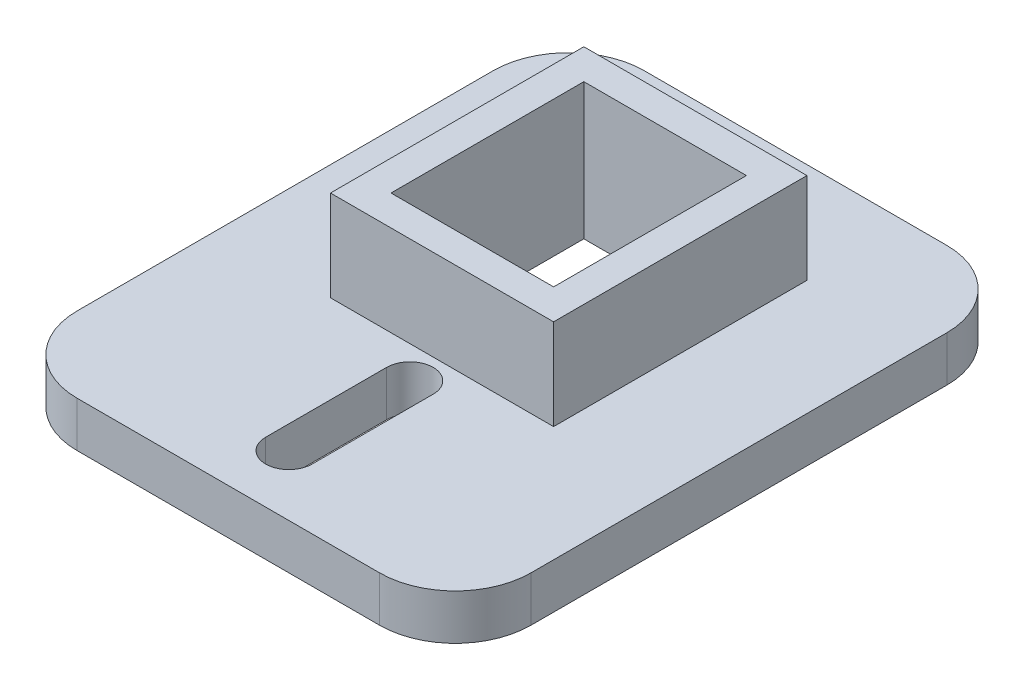
ISO-10303-21;
HEADER;
FILE_DESCRIPTION(('STEP AP214'),'2;1');
FILE_NAME('part.step','',(''),(''),'','','');
FILE_SCHEMA(('AUTOMOTIVE_DESIGN { 1 0 10303 214 1 1 1 1 }'));
ENDSEC;
DATA;
#1=APPLICATION_CONTEXT('core data for automotive mechanical design processes');
#2=APPLICATION_PROTOCOL_DEFINITION('international standard','automotive_design',2000,#1);
#3=PRODUCT_CONTEXT('',#1,'mechanical');
#4=PRODUCT('Part','Part','',(#3));
#5=PRODUCT_RELATED_PRODUCT_CATEGORY('part','',(#4));
#6=PRODUCT_DEFINITION_FORMATION('','',#4);
#7=PRODUCT_DEFINITION_CONTEXT('part definition',#1,'design');
#8=PRODUCT_DEFINITION('design','',#6,#7);
#9=PRODUCT_DEFINITION_SHAPE('','',#8);
#10=(LENGTH_UNIT() NAMED_UNIT(*) SI_UNIT(.MILLI.,.METRE.));
#11=(NAMED_UNIT(*) PLANE_ANGLE_UNIT() SI_UNIT($,.RADIAN.));
#12=(NAMED_UNIT(*) SI_UNIT($,.STERADIAN.) SOLID_ANGLE_UNIT());
#13=UNCERTAINTY_MEASURE_WITH_UNIT(LENGTH_MEASURE(1.E-05),#10,'distance_accuracy_value','');
#14=(GEOMETRIC_REPRESENTATION_CONTEXT(3) GLOBAL_UNCERTAINTY_ASSIGNED_CONTEXT((#13)) GLOBAL_UNIT_ASSIGNED_CONTEXT((#10,
#11,#12)) REPRESENTATION_CONTEXT('',''));
#15=CARTESIAN_POINT('',(0.,0.,0.));
#16=DIRECTION('',(0.,0.,1.));
#17=DIRECTION('',(1.,0.,0.));
#18=AXIS2_PLACEMENT_3D('',#15,#16,#17);
#19=CARTESIAN_POINT('',(0.,3.,0.));
#20=DIRECTION('',(0.,-1.,0.));
#21=DIRECTION('',(0.,0.,-1.));
#22=AXIS2_PLACEMENT_3D('',#19,#20,#21);
#23=PLANE('',#22);
#24=CARTESIAN_POINT('',(0.,3.,11.125));
#25=DIRECTION('',(0.,1.,0.));
#26=DIRECTION('',(0.,0.,1.));
#27=AXIS2_PLACEMENT_3D('',#24,#25,#26);
#28=CIRCLE('',#27,1.5375);
#29=CARTESIAN_POINT('',(1.5375,3.,11.125));
#30=VERTEX_POINT('',#29);
#31=CARTESIAN_POINT('',(-1.5375,3.,11.125));
#32=VERTEX_POINT('',#31);
#33=EDGE_CURVE('E226',#30,#32,#28,.T.);
#34=ORIENTED_EDGE('',*,*,#33,.F.);
#35=DIRECTION('',(0.,0.,-1.));
#36=VECTOR('',#35,1.);
#37=CARTESIAN_POINT('',(1.5375,3.,11.125));
#38=LINE('',#37,#36);
#39=CARTESIAN_POINT('',(1.5375,3.,19.125));
#40=VERTEX_POINT('',#39);
#41=EDGE_CURVE('E234',#40,#30,#38,.T.);
#42=ORIENTED_EDGE('',*,*,#41,.F.);
#43=CARTESIAN_POINT('',(0.,3.,19.125));
#44=DIRECTION('',(0.,1.,0.));
#45=DIRECTION('',(0.,0.,1.));
#46=AXIS2_PLACEMENT_3D('',#43,#44,#45);
#47=CIRCLE('',#46,1.5375);
#48=CARTESIAN_POINT('',(-1.5375,3.,19.125));
#49=VERTEX_POINT('',#48);
#50=EDGE_CURVE('E231',#49,#40,#47,.T.);
#51=ORIENTED_EDGE('',*,*,#50,.F.);
#52=DIRECTION('',(0.,0.,1.));
#53=VECTOR('',#52,1.);
#54=CARTESIAN_POINT('',(-1.5375,3.,11.125));
#55=LINE('',#54,#53);
#56=EDGE_CURVE('E228',#32,#49,#55,.T.);
#57=ORIENTED_EDGE('',*,*,#56,.F.);
#58=EDGE_LOOP('',(#34,#42,#51,#57));
#59=FACE_BOUND('',#58,.T.);
#60=DIRECTION('',(1.,0.,0.));
#61=VECTOR('',#60,1.);
#62=CARTESIAN_POINT('',(-15.,3.,23.125));
#63=LINE('',#62,#61);
#64=CARTESIAN_POINT('',(-9.99999999999999,3.,23.125));
#65=VERTEX_POINT('',#64);
#66=CARTESIAN_POINT('',(10.,3.,23.125));
#67=VERTEX_POINT('',#66);
#68=EDGE_CURVE('E281',#65,#67,#63,.T.);
#69=ORIENTED_EDGE('',*,*,#68,.T.);
#70=CARTESIAN_POINT('',(10.,3.,18.125));
#71=DIRECTION('',(0.,-1.,0.));
#72=DIRECTION('',(0.,0.,-1.));
#73=AXIS2_PLACEMENT_3D('',#70,#71,#72);
#74=CIRCLE('',#73,5.);
#75=CARTESIAN_POINT('',(15.,3.,18.125));
#76=VERTEX_POINT('',#75);
#77=EDGE_CURVE('E318',#67,#76,#74,.F.);
#78=ORIENTED_EDGE('',*,*,#77,.T.);
#79=DIRECTION('',(0.,0.,-1.));
#80=VECTOR('',#79,1.);
#81=CARTESIAN_POINT('',(15.,3.,23.125));
#82=LINE('',#81,#80);
#83=CARTESIAN_POINT('',(15.,3.,-9.37500000000001));
#84=VERTEX_POINT('',#83);
#85=EDGE_CURVE('E271',#76,#84,#82,.T.);
#86=ORIENTED_EDGE('',*,*,#85,.T.);
#87=CARTESIAN_POINT('',(10.,3.,-9.375));
#88=DIRECTION('',(0.,-1.,0.));
#89=DIRECTION('',(0.,0.,-1.));
#90=AXIS2_PLACEMENT_3D('',#87,#88,#89);
#91=CIRCLE('',#90,5.);
#92=CARTESIAN_POINT('',(9.99999999999999,3.,-14.375));
#93=VERTEX_POINT('',#92);
#94=EDGE_CURVE('E314',#84,#93,#91,.F.);
#95=ORIENTED_EDGE('',*,*,#94,.T.);
#96=DIRECTION('',(-1.,0.,0.));
#97=VECTOR('',#96,1.);
#98=CARTESIAN_POINT('',(-15.,3.,-14.375));
#99=LINE('',#98,#97);
#100=CARTESIAN_POINT('',(-10.,3.,-14.375));
#101=VERTEX_POINT('',#100);
#102=EDGE_CURVE('E274',#93,#101,#99,.T.);
#103=ORIENTED_EDGE('',*,*,#102,.T.);
#104=CARTESIAN_POINT('',(-9.99999999999999,3.,-9.37499999999999));
#105=DIRECTION('',(0.,-1.,0.));
#106=DIRECTION('',(0.,0.,-1.));
#107=AXIS2_PLACEMENT_3D('',#104,#105,#106);
#108=CIRCLE('',#107,5.);
#109=CARTESIAN_POINT('',(-15.,3.,-9.37499999999999));
#110=VERTEX_POINT('',#109);
#111=EDGE_CURVE('E312',#101,#110,#108,.F.);
#112=ORIENTED_EDGE('',*,*,#111,.T.);
#113=DIRECTION('',(0.,0.,1.));
#114=VECTOR('',#113,1.);
#115=CARTESIAN_POINT('',(-15.,3.,23.125));
#116=LINE('',#115,#114);
#117=CARTESIAN_POINT('',(-15.,3.,18.125));
#118=VERTEX_POINT('',#117);
#119=EDGE_CURVE('E278',#110,#118,#116,.T.);
#120=ORIENTED_EDGE('',*,*,#119,.T.);
#121=CARTESIAN_POINT('',(-9.99999999999999,3.,18.125));
#122=DIRECTION('',(0.,-1.,0.));
#123=DIRECTION('',(0.,0.,-1.));
#124=AXIS2_PLACEMENT_3D('',#121,#122,#123);
#125=CIRCLE('',#124,5.);
#126=EDGE_CURVE('E316',#118,#65,#125,.F.);
#127=ORIENTED_EDGE('',*,*,#126,.T.);
#128=EDGE_LOOP('',(#69,#78,#86,#95,#103,#112,#120,#127));
#129=FACE_BOUND('',#128,.T.);
#130=DIRECTION('',(-1.,0.,0.));
#131=VECTOR('',#130,1.);
#132=CARTESIAN_POINT('',(-7.375,3.,-7.75));
#133=LINE('',#132,#131);
#134=CARTESIAN_POINT('',(7.375,3.,-7.75));
#135=VERTEX_POINT('',#134);
#136=CARTESIAN_POINT('',(-7.375,3.,-7.75));
#137=VERTEX_POINT('',#136);
#138=EDGE_CURVE('E197',#135,#137,#133,.T.);
#139=ORIENTED_EDGE('',*,*,#138,.F.);
#140=DIRECTION('',(0.,0.,-1.));
#141=VECTOR('',#140,1.);
#142=CARTESIAN_POINT('',(7.375,3.,-7.75));
#143=LINE('',#142,#141);
#144=CARTESIAN_POINT('',(7.375,3.,9.));
#145=VERTEX_POINT('',#144);
#146=EDGE_CURVE('E202',#145,#135,#143,.T.);
#147=ORIENTED_EDGE('',*,*,#146,.F.);
#148=DIRECTION('',(1.,0.,0.));
#149=VECTOR('',#148,1.);
#150=CARTESIAN_POINT('',(-7.375,3.,9.));
#151=LINE('',#150,#149);
#152=CARTESIAN_POINT('',(-7.375,3.,9.));
#153=VERTEX_POINT('',#152);
#154=EDGE_CURVE('E52',#153,#145,#151,.T.);
#155=ORIENTED_EDGE('',*,*,#154,.F.);
#156=DIRECTION('',(0.,0.,1.));
#157=VECTOR('',#156,1.);
#158=CARTESIAN_POINT('',(-7.375,3.,-7.75));
#159=LINE('',#158,#157);
#160=EDGE_CURVE('E47',#137,#153,#159,.T.);
#161=ORIENTED_EDGE('',*,*,#160,.F.);
#162=EDGE_LOOP('',(#139,#147,#155,#161));
#163=FACE_BOUND('',#162,.T.);
#164=ADVANCED_FACE('F32',(#59,#129,#163),#23,.F.);
#165=CARTESIAN_POINT('',(0.,0.,0.));
#166=DIRECTION('',(0.,-1.,0.));
#167=DIRECTION('',(0.,0.,-1.));
#168=AXIS2_PLACEMENT_3D('',#165,#166,#167);
#169=PLANE('',#168);
#170=DIRECTION('',(0.,0.,-1.));
#171=VECTOR('',#170,1.);
#172=CARTESIAN_POINT('',(15.,0.,23.125));
#173=LINE('',#172,#171);
#174=CARTESIAN_POINT('',(15.,0.,18.125));
#175=VERTEX_POINT('',#174);
#176=CARTESIAN_POINT('',(15.,0.,-9.37500000000001));
#177=VERTEX_POINT('',#176);
#178=EDGE_CURVE('E270',#175,#177,#173,.T.);
#179=ORIENTED_EDGE('',*,*,#178,.F.);
#180=CARTESIAN_POINT('',(10.,0.,18.125));
#181=DIRECTION('',(0.,-1.,0.));
#182=DIRECTION('',(0.,0.,-1.));
#183=AXIS2_PLACEMENT_3D('',#180,#181,#182);
#184=CIRCLE('',#183,5.);
#185=CARTESIAN_POINT('',(10.,0.,23.125));
#186=VERTEX_POINT('',#185);
#187=EDGE_CURVE('E305',#175,#186,#184,.T.);
#188=ORIENTED_EDGE('',*,*,#187,.T.);
#189=DIRECTION('',(1.,0.,0.));
#190=VECTOR('',#189,1.);
#191=CARTESIAN_POINT('',(-15.,0.,23.125));
#192=LINE('',#191,#190);
#193=CARTESIAN_POINT('',(-9.99999999999999,0.,23.125));
#194=VERTEX_POINT('',#193);
#195=EDGE_CURVE('E275',#194,#186,#192,.T.);
#196=ORIENTED_EDGE('',*,*,#195,.F.);
#197=CARTESIAN_POINT('',(-9.99999999999999,0.,18.125));
#198=DIRECTION('',(0.,-1.,0.));
#199=DIRECTION('',(0.,0.,-1.));
#200=AXIS2_PLACEMENT_3D('',#197,#198,#199);
#201=CIRCLE('',#200,5.);
#202=CARTESIAN_POINT('',(-15.,0.,18.125));
#203=VERTEX_POINT('',#202);
#204=EDGE_CURVE('E303',#194,#203,#201,.T.);
#205=ORIENTED_EDGE('',*,*,#204,.T.);
#206=DIRECTION('',(0.,0.,1.));
#207=VECTOR('',#206,1.);
#208=CARTESIAN_POINT('',(-15.,0.,23.125));
#209=LINE('',#208,#207);
#210=CARTESIAN_POINT('',(-15.,0.,-9.37499999999999));
#211=VERTEX_POINT('',#210);
#212=EDGE_CURVE('E290',#211,#203,#209,.T.);
#213=ORIENTED_EDGE('',*,*,#212,.F.);
#214=CARTESIAN_POINT('',(-9.99999999999999,0.,-9.37499999999999));
#215=DIRECTION('',(0.,-1.,0.));
#216=DIRECTION('',(0.,0.,-1.));
#217=AXIS2_PLACEMENT_3D('',#214,#215,#216);
#218=CIRCLE('',#217,5.);
#219=CARTESIAN_POINT('',(-10.,0.,-14.375));
#220=VERTEX_POINT('',#219);
#221=EDGE_CURVE('E299',#211,#220,#218,.T.);
#222=ORIENTED_EDGE('',*,*,#221,.T.);
#223=DIRECTION('',(-1.,0.,0.));
#224=VECTOR('',#223,1.);
#225=CARTESIAN_POINT('',(-15.,0.,-14.375));
#226=LINE('',#225,#224);
#227=CARTESIAN_POINT('',(9.99999999999999,0.,-14.375));
#228=VERTEX_POINT('',#227);
#229=EDGE_CURVE('E287',#228,#220,#226,.T.);
#230=ORIENTED_EDGE('',*,*,#229,.F.);
#231=CARTESIAN_POINT('',(10.,0.,-9.375));
#232=DIRECTION('',(0.,-1.,0.));
#233=DIRECTION('',(0.,0.,-1.));
#234=AXIS2_PLACEMENT_3D('',#231,#232,#233);
#235=CIRCLE('',#234,5.);
#236=EDGE_CURVE('E301',#228,#177,#235,.T.);
#237=ORIENTED_EDGE('',*,*,#236,.T.);
#238=EDGE_LOOP('',(#179,#188,#196,#205,#213,#222,#230,#237));
#239=FACE_BOUND('',#238,.T.);
#240=DIRECTION('',(1.,0.,0.));
#241=VECTOR('',#240,1.);
#242=CARTESIAN_POINT('',(-5.375,0.,7.));
#243=LINE('',#242,#241);
#244=CARTESIAN_POINT('',(-5.375,0.,7.));
#245=VERTEX_POINT('',#244);
#246=CARTESIAN_POINT('',(5.375,0.,7.));
#247=VERTEX_POINT('',#246);
#248=EDGE_CURVE('E175',#245,#247,#243,.T.);
#249=ORIENTED_EDGE('',*,*,#248,.T.);
#250=DIRECTION('',(0.,0.,-1.));
#251=VECTOR('',#250,1.);
#252=CARTESIAN_POINT('',(5.375,0.,7.));
#253=LINE('',#252,#251);
#254=CARTESIAN_POINT('',(5.375,0.,-5.75));
#255=VERTEX_POINT('',#254);
#256=EDGE_CURVE('E256',#247,#255,#253,.T.);
#257=ORIENTED_EDGE('',*,*,#256,.T.);
#258=DIRECTION('',(-1.,0.,0.));
#259=VECTOR('',#258,1.);
#260=CARTESIAN_POINT('',(-5.375,0.,-5.75));
#261=LINE('',#260,#259);
#262=CARTESIAN_POINT('',(-5.375,0.,-5.75));
#263=VERTEX_POINT('',#262);
#264=EDGE_CURVE('E259',#255,#263,#261,.T.);
#265=ORIENTED_EDGE('',*,*,#264,.T.);
#266=DIRECTION('',(0.,0.,1.));
#267=VECTOR('',#266,1.);
#268=CARTESIAN_POINT('',(-5.375,0.,7.));
#269=LINE('',#268,#267);
#270=EDGE_CURVE('E262',#263,#245,#269,.T.);
#271=ORIENTED_EDGE('',*,*,#270,.T.);
#272=EDGE_LOOP('',(#249,#257,#265,#271));
#273=FACE_BOUND('',#272,.T.);
#274=DIRECTION('',(0.,0.,-1.));
#275=VECTOR('',#274,1.);
#276=CARTESIAN_POINT('',(1.5375,0.,11.125));
#277=LINE('',#276,#275);
#278=CARTESIAN_POINT('',(1.5375,0.,19.125));
#279=VERTEX_POINT('',#278);
#280=CARTESIAN_POINT('',(1.5375,0.,11.125));
#281=VERTEX_POINT('',#280);
#282=EDGE_CURVE('E229',#279,#281,#277,.T.);
#283=ORIENTED_EDGE('',*,*,#282,.T.);
#284=CARTESIAN_POINT('',(0.,0.,11.125));
#285=DIRECTION('',(0.,1.,0.));
#286=DIRECTION('',(0.,0.,1.));
#287=AXIS2_PLACEMENT_3D('',#284,#285,#286);
#288=CIRCLE('',#287,1.5375);
#289=CARTESIAN_POINT('',(-1.5375,0.,11.125));
#290=VERTEX_POINT('',#289);
#291=EDGE_CURVE('E225',#281,#290,#288,.T.);
#292=ORIENTED_EDGE('',*,*,#291,.T.);
#293=DIRECTION('',(0.,0.,1.));
#294=VECTOR('',#293,1.);
#295=CARTESIAN_POINT('',(-1.5375,0.,11.125));
#296=LINE('',#295,#294);
#297=CARTESIAN_POINT('',(-1.5375,0.,19.125));
#298=VERTEX_POINT('',#297);
#299=EDGE_CURVE('E239',#290,#298,#296,.T.);
#300=ORIENTED_EDGE('',*,*,#299,.T.);
#301=CARTESIAN_POINT('',(0.,0.,19.125));
#302=DIRECTION('',(0.,1.,0.));
#303=DIRECTION('',(0.,0.,1.));
#304=AXIS2_PLACEMENT_3D('',#301,#302,#303);
#305=CIRCLE('',#304,1.5375);
#306=EDGE_CURVE('E242',#298,#279,#305,.T.);
#307=ORIENTED_EDGE('',*,*,#306,.T.);
#308=EDGE_LOOP('',(#283,#292,#300,#307));
#309=FACE_BOUND('',#308,.T.);
#310=ADVANCED_FACE('F342',(#239,#273,#309),#169,.T.);
#311=CARTESIAN_POINT('',(15.,3.,23.125));
#312=DIRECTION('',(-1.,0.,0.));
#313=DIRECTION('',(0.,0.,1.));
#314=AXIS2_PLACEMENT_3D('',#311,#312,#313);
#315=PLANE('',#314);
#316=ORIENTED_EDGE('',*,*,#85,.F.);
#317=DIRECTION('',(0.,-1.,0.));
#318=VECTOR('',#317,1.);
#319=CARTESIAN_POINT('',(15.,3.,18.125));
#320=LINE('',#319,#318);
#321=EDGE_CURVE('E296',#76,#175,#320,.T.);
#322=ORIENTED_EDGE('',*,*,#321,.T.);
#323=ORIENTED_EDGE('',*,*,#178,.T.);
#324=DIRECTION('',(0.,-1.,0.));
#325=VECTOR('',#324,1.);
#326=CARTESIAN_POINT('',(15.,3.,-9.37500000000001));
#327=LINE('',#326,#325);
#328=EDGE_CURVE('E284',#177,#84,#327,.F.);
#329=ORIENTED_EDGE('',*,*,#328,.T.);
#330=EDGE_LOOP('',(#316,#322,#323,#329));
#331=FACE_BOUND('',#330,.T.);
#332=ADVANCED_FACE('F359',(#331),#315,.F.);
#333=CARTESIAN_POINT('',(-15.,3.,-14.375));
#334=DIRECTION('',(0.,0.,1.));
#335=DIRECTION('',(1.,0.,0.));
#336=AXIS2_PLACEMENT_3D('',#333,#334,#335);
#337=PLANE('',#336);
#338=ORIENTED_EDGE('',*,*,#102,.F.);
#339=DIRECTION('',(0.,-1.,0.));
#340=VECTOR('',#339,1.);
#341=CARTESIAN_POINT('',(10.,3.,-14.375));
#342=LINE('',#341,#340);
#343=EDGE_CURVE('E11',#93,#228,#342,.T.);
#344=ORIENTED_EDGE('',*,*,#343,.T.);
#345=ORIENTED_EDGE('',*,*,#229,.T.);
#346=DIRECTION('',(0.,-1.,0.));
#347=VECTOR('',#346,1.);
#348=CARTESIAN_POINT('',(-9.99999999999999,3.,-14.375));
#349=LINE('',#348,#347);
#350=EDGE_CURVE('E40',#220,#101,#349,.F.);
#351=ORIENTED_EDGE('',*,*,#350,.T.);
#352=EDGE_LOOP('',(#338,#344,#345,#351));
#353=FACE_BOUND('',#352,.T.);
#354=ADVANCED_FACE('F327',(#353),#337,.F.);
#355=CARTESIAN_POINT('',(-15.,3.,23.125));
#356=DIRECTION('',(1.,0.,0.));
#357=DIRECTION('',(0.,0.,-1.));
#358=AXIS2_PLACEMENT_3D('',#355,#356,#357);
#359=PLANE('',#358);
#360=ORIENTED_EDGE('',*,*,#212,.T.);
#361=DIRECTION('',(0.,-1.,0.));
#362=VECTOR('',#361,1.);
#363=CARTESIAN_POINT('',(-15.,3.,18.125));
#364=LINE('',#363,#362);
#365=EDGE_CURVE('E323',#203,#118,#364,.F.);
#366=ORIENTED_EDGE('',*,*,#365,.T.);
#367=ORIENTED_EDGE('',*,*,#119,.F.);
#368=DIRECTION('',(0.,-1.,0.));
#369=VECTOR('',#368,1.);
#370=CARTESIAN_POINT('',(-15.,3.,-9.37499999999999));
#371=LINE('',#370,#369);
#372=EDGE_CURVE('E320',#110,#211,#371,.T.);
#373=ORIENTED_EDGE('',*,*,#372,.T.);
#374=EDGE_LOOP('',(#360,#366,#367,#373));
#375=FACE_BOUND('',#374,.T.);
#376=ADVANCED_FACE('F338',(#375),#359,.F.);
#377=CARTESIAN_POINT('',(-15.,3.,23.125));
#378=DIRECTION('',(0.,0.,-1.));
#379=DIRECTION('',(-1.,0.,0.));
#380=AXIS2_PLACEMENT_3D('',#377,#378,#379);
#381=PLANE('',#380);
#382=ORIENTED_EDGE('',*,*,#195,.T.);
#383=DIRECTION('',(0.,-1.,0.));
#384=VECTOR('',#383,1.);
#385=CARTESIAN_POINT('',(10.,3.,23.125));
#386=LINE('',#385,#384);
#387=EDGE_CURVE('E310',#186,#67,#386,.F.);
#388=ORIENTED_EDGE('',*,*,#387,.T.);
#389=ORIENTED_EDGE('',*,*,#68,.F.);
#390=DIRECTION('',(0.,-1.,0.));
#391=VECTOR('',#390,1.);
#392=CARTESIAN_POINT('',(-9.99999999999999,3.,23.125));
#393=LINE('',#392,#391);
#394=EDGE_CURVE('E307',#65,#194,#393,.T.);
#395=ORIENTED_EDGE('',*,*,#394,.T.);
#396=EDGE_LOOP('',(#382,#388,#389,#395));
#397=FACE_BOUND('',#396,.T.);
#398=ADVANCED_FACE('F351',(#397),#381,.F.);
#399=CARTESIAN_POINT('',(5.375,3.,7.));
#400=DIRECTION('',(-1.,0.,0.));
#401=DIRECTION('',(0.,0.,1.));
#402=AXIS2_PLACEMENT_3D('',#399,#400,#401);
#403=PLANE('',#402);
#404=ORIENTED_EDGE('',*,*,#256,.F.);
#405=DIRECTION('',(0.,-1.,0.));
#406=VECTOR('',#405,1.);
#407=CARTESIAN_POINT('',(5.375,3.,7.));
#408=LINE('',#407,#406);
#409=CARTESIAN_POINT('',(5.375,9.,7.));
#410=VERTEX_POINT('',#409);
#411=EDGE_CURVE('E180',#410,#247,#408,.T.);
#412=ORIENTED_EDGE('',*,*,#411,.F.);
#413=DIRECTION('',(0.,0.,-1.));
#414=VECTOR('',#413,1.);
#415=CARTESIAN_POINT('',(5.375,9.,-5.75));
#416=LINE('',#415,#414);
#417=CARTESIAN_POINT('',(5.375,9.,-5.75));
#418=VERTEX_POINT('',#417);
#419=EDGE_CURVE('E191',#410,#418,#416,.T.);
#420=ORIENTED_EDGE('',*,*,#419,.T.);
#421=DIRECTION('',(0.,-1.,0.));
#422=VECTOR('',#421,1.);
#423=CARTESIAN_POINT('',(5.375,3.,-5.75));
#424=LINE('',#423,#422);
#425=EDGE_CURVE('E267',#418,#255,#424,.T.);
#426=ORIENTED_EDGE('',*,*,#425,.T.);
#427=EDGE_LOOP('',(#404,#412,#420,#426));
#428=FACE_BOUND('',#427,.T.);
#429=ADVANCED_FACE('F378',(#428),#403,.T.);
#430=CARTESIAN_POINT('',(-5.375,3.,-5.75));
#431=DIRECTION('',(0.,0.,1.));
#432=DIRECTION('',(1.,0.,0.));
#433=AXIS2_PLACEMENT_3D('',#430,#431,#432);
#434=PLANE('',#433);
#435=ORIENTED_EDGE('',*,*,#264,.F.);
#436=ORIENTED_EDGE('',*,*,#425,.F.);
#437=DIRECTION('',(-1.,0.,0.));
#438=VECTOR('',#437,1.);
#439=CARTESIAN_POINT('',(-5.375,9.,-5.75));
#440=LINE('',#439,#438);
#441=CARTESIAN_POINT('',(-5.375,9.,-5.75));
#442=VERTEX_POINT('',#441);
#443=EDGE_CURVE('E193',#418,#442,#440,.T.);
#444=ORIENTED_EDGE('',*,*,#443,.T.);
#445=DIRECTION('',(0.,-1.,0.));
#446=VECTOR('',#445,1.);
#447=CARTESIAN_POINT('',(-5.375,3.,-5.75));
#448=LINE('',#447,#446);
#449=EDGE_CURVE('E179',#442,#263,#448,.T.);
#450=ORIENTED_EDGE('',*,*,#449,.T.);
#451=EDGE_LOOP('',(#435,#436,#444,#450));
#452=FACE_BOUND('',#451,.T.);
#453=ADVANCED_FACE('F418',(#452),#434,.T.);
#454=CARTESIAN_POINT('',(-5.375,3.,7.));
#455=DIRECTION('',(1.,0.,0.));
#456=DIRECTION('',(0.,0.,-1.));
#457=AXIS2_PLACEMENT_3D('',#454,#455,#456);
#458=PLANE('',#457);
#459=ORIENTED_EDGE('',*,*,#270,.F.);
#460=ORIENTED_EDGE('',*,*,#449,.F.);
#461=DIRECTION('',(0.,0.,1.));
#462=VECTOR('',#461,1.);
#463=CARTESIAN_POINT('',(-5.375,9.,-5.75));
#464=LINE('',#463,#462);
#465=CARTESIAN_POINT('',(-5.375,9.,7.));
#466=VERTEX_POINT('',#465);
#467=EDGE_CURVE('E183',#442,#466,#464,.T.);
#468=ORIENTED_EDGE('',*,*,#467,.T.);
#469=DIRECTION('',(0.,-1.,0.));
#470=VECTOR('',#469,1.);
#471=CARTESIAN_POINT('',(-5.375,3.,7.));
#472=LINE('',#471,#470);
#473=EDGE_CURVE('E167',#466,#245,#472,.T.);
#474=ORIENTED_EDGE('',*,*,#473,.T.);
#475=EDGE_LOOP('',(#459,#460,#468,#474));
#476=FACE_BOUND('',#475,.T.);
#477=ADVANCED_FACE('F184',(#476),#458,.T.);
#478=CARTESIAN_POINT('',(-5.375,3.,7.));
#479=DIRECTION('',(0.,0.,-1.));
#480=DIRECTION('',(-1.,0.,0.));
#481=AXIS2_PLACEMENT_3D('',#478,#479,#480);
#482=PLANE('',#481);
#483=ORIENTED_EDGE('',*,*,#248,.F.);
#484=ORIENTED_EDGE('',*,*,#473,.F.);
#485=DIRECTION('',(1.,0.,0.));
#486=VECTOR('',#485,1.);
#487=CARTESIAN_POINT('',(-5.375,9.,7.));
#488=LINE('',#487,#486);
#489=EDGE_CURVE('E172',#466,#410,#488,.T.);
#490=ORIENTED_EDGE('',*,*,#489,.T.);
#491=ORIENTED_EDGE('',*,*,#411,.T.);
#492=EDGE_LOOP('',(#483,#484,#490,#491));
#493=FACE_BOUND('',#492,.T.);
#494=ADVANCED_FACE('F169',(#493),#482,.T.);
#495=CARTESIAN_POINT('',(0.,3.,11.125));
#496=DIRECTION('',(0.,-1.,0.));
#497=DIRECTION('',(0.,0.,-1.));
#498=AXIS2_PLACEMENT_3D('',#495,#496,#497);
#499=CYLINDRICAL_SURFACE('',#498,1.5375);
#500=ORIENTED_EDGE('',*,*,#291,.F.);
#501=DIRECTION('',(0.,-1.,0.));
#502=VECTOR('',#501,1.);
#503=CARTESIAN_POINT('',(1.5375,3.,11.125));
#504=LINE('',#503,#502);
#505=EDGE_CURVE('E236',#30,#281,#504,.T.);
#506=ORIENTED_EDGE('',*,*,#505,.F.);
#507=ORIENTED_EDGE('',*,*,#33,.T.);
#508=DIRECTION('',(0.,-1.,0.));
#509=VECTOR('',#508,1.);
#510=CARTESIAN_POINT('',(-1.5375,3.,11.125));
#511=LINE('',#510,#509);
#512=EDGE_CURVE('E253',#32,#290,#511,.T.);
#513=ORIENTED_EDGE('',*,*,#512,.T.);
#514=EDGE_LOOP('',(#500,#506,#507,#513));
#515=FACE_BOUND('',#514,.T.);
#516=ADVANCED_FACE('F410',(#515),#499,.F.);
#517=CARTESIAN_POINT('',(-1.5375,3.,11.125));
#518=DIRECTION('',(1.,0.,0.));
#519=DIRECTION('',(0.,0.,-1.));
#520=AXIS2_PLACEMENT_3D('',#517,#518,#519);
#521=PLANE('',#520);
#522=ORIENTED_EDGE('',*,*,#299,.F.);
#523=ORIENTED_EDGE('',*,*,#512,.F.);
#524=ORIENTED_EDGE('',*,*,#56,.T.);
#525=DIRECTION('',(0.,-1.,0.));
#526=VECTOR('',#525,1.);
#527=CARTESIAN_POINT('',(-1.5375,3.,19.125));
#528=LINE('',#527,#526);
#529=EDGE_CURVE('E251',#49,#298,#528,.T.);
#530=ORIENTED_EDGE('',*,*,#529,.T.);
#531=EDGE_LOOP('',(#522,#523,#524,#530));
#532=FACE_BOUND('',#531,.T.);
#533=ADVANCED_FACE('F400',(#532),#521,.T.);
#534=CARTESIAN_POINT('',(0.,3.,19.125));
#535=DIRECTION('',(0.,-1.,0.));
#536=DIRECTION('',(0.,0.,-1.));
#537=AXIS2_PLACEMENT_3D('',#534,#535,#536);
#538=CYLINDRICAL_SURFACE('',#537,1.5375);
#539=ORIENTED_EDGE('',*,*,#306,.F.);
#540=ORIENTED_EDGE('',*,*,#529,.F.);
#541=ORIENTED_EDGE('',*,*,#50,.T.);
#542=DIRECTION('',(0.,-1.,0.));
#543=VECTOR('',#542,1.);
#544=CARTESIAN_POINT('',(1.5375,3.,19.125));
#545=LINE('',#544,#543);
#546=EDGE_CURVE('E249',#40,#279,#545,.T.);
#547=ORIENTED_EDGE('',*,*,#546,.T.);
#548=EDGE_LOOP('',(#539,#540,#541,#547));
#549=FACE_BOUND('',#548,.T.);
#550=ADVANCED_FACE('F394',(#549),#538,.F.);
#551=CARTESIAN_POINT('',(1.5375,3.,11.125));
#552=DIRECTION('',(-1.,0.,0.));
#553=DIRECTION('',(0.,0.,1.));
#554=AXIS2_PLACEMENT_3D('',#551,#552,#553);
#555=PLANE('',#554);
#556=ORIENTED_EDGE('',*,*,#282,.F.);
#557=ORIENTED_EDGE('',*,*,#546,.F.);
#558=ORIENTED_EDGE('',*,*,#41,.T.);
#559=ORIENTED_EDGE('',*,*,#505,.T.);
#560=EDGE_LOOP('',(#556,#557,#558,#559));
#561=FACE_BOUND('',#560,.T.);
#562=ADVANCED_FACE('F390',(#561),#555,.T.);
#563=CARTESIAN_POINT('',(10.,3.,18.125));
#564=DIRECTION('',(0.,-1.,0.));
#565=DIRECTION('',(0.,0.,-1.));
#566=AXIS2_PLACEMENT_3D('',#563,#564,#565);
#567=CYLINDRICAL_SURFACE('',#566,5.);
#568=ORIENTED_EDGE('',*,*,#77,.F.);
#569=ORIENTED_EDGE('',*,*,#387,.F.);
#570=ORIENTED_EDGE('',*,*,#187,.F.);
#571=ORIENTED_EDGE('',*,*,#321,.F.);
#572=EDGE_LOOP('',(#568,#569,#570,#571));
#573=FACE_BOUND('',#572,.T.);
#574=ADVANCED_FACE('F357',(#573),#567,.T.);
#575=CARTESIAN_POINT('',(-9.99999999999999,3.,18.125));
#576=DIRECTION('',(0.,-1.,0.));
#577=DIRECTION('',(0.,0.,-1.));
#578=AXIS2_PLACEMENT_3D('',#575,#576,#577);
#579=CYLINDRICAL_SURFACE('',#578,5.);
#580=ORIENTED_EDGE('',*,*,#126,.F.);
#581=ORIENTED_EDGE('',*,*,#365,.F.);
#582=ORIENTED_EDGE('',*,*,#204,.F.);
#583=ORIENTED_EDGE('',*,*,#394,.F.);
#584=EDGE_LOOP('',(#580,#581,#582,#583));
#585=FACE_BOUND('',#584,.T.);
#586=ADVANCED_FACE('F348',(#585),#579,.T.);
#587=CARTESIAN_POINT('',(10.,3.,-9.375));
#588=DIRECTION('',(0.,-1.,0.));
#589=DIRECTION('',(0.,0.,-1.));
#590=AXIS2_PLACEMENT_3D('',#587,#588,#589);
#591=CYLINDRICAL_SURFACE('',#590,5.);
#592=ORIENTED_EDGE('',*,*,#94,.F.);
#593=ORIENTED_EDGE('',*,*,#328,.F.);
#594=ORIENTED_EDGE('',*,*,#236,.F.);
#595=ORIENTED_EDGE('',*,*,#343,.F.);
#596=EDGE_LOOP('',(#592,#593,#594,#595));
#597=FACE_BOUND('',#596,.T.);
#598=ADVANCED_FACE('F362',(#597),#591,.T.);
#599=CARTESIAN_POINT('',(-9.99999999999999,3.,-9.37499999999999));
#600=DIRECTION('',(0.,-1.,0.));
#601=DIRECTION('',(0.,0.,-1.));
#602=AXIS2_PLACEMENT_3D('',#599,#600,#601);
#603=CYLINDRICAL_SURFACE('',#602,5.);
#604=ORIENTED_EDGE('',*,*,#111,.F.);
#605=ORIENTED_EDGE('',*,*,#350,.F.);
#606=ORIENTED_EDGE('',*,*,#221,.F.);
#607=ORIENTED_EDGE('',*,*,#372,.F.);
#608=EDGE_LOOP('',(#604,#605,#606,#607));
#609=FACE_BOUND('',#608,.T.);
#610=ADVANCED_FACE('F34',(#609),#603,.T.);
#611=CARTESIAN_POINT('',(0.,9.,0.));
#612=DIRECTION('',(0.,-1.,0.));
#613=DIRECTION('',(0.,0.,-1.));
#614=AXIS2_PLACEMENT_3D('',#611,#612,#613);
#615=PLANE('',#614);
#616=DIRECTION('',(-1.,0.,0.));
#617=VECTOR('',#616,1.);
#618=CARTESIAN_POINT('',(-7.375,9.,-7.75));
#619=LINE('',#618,#617);
#620=CARTESIAN_POINT('',(7.375,9.,-7.75));
#621=VERTEX_POINT('',#620);
#622=CARTESIAN_POINT('',(-7.375,9.,-7.75));
#623=VERTEX_POINT('',#622);
#624=EDGE_CURVE('E198',#621,#623,#619,.T.);
#625=ORIENTED_EDGE('',*,*,#624,.T.);
#626=DIRECTION('',(0.,0.,1.));
#627=VECTOR('',#626,1.);
#628=CARTESIAN_POINT('',(-7.375,9.,-7.75));
#629=LINE('',#628,#627);
#630=CARTESIAN_POINT('',(-7.375,9.,9.));
#631=VERTEX_POINT('',#630);
#632=EDGE_CURVE('E201',#623,#631,#629,.T.);
#633=ORIENTED_EDGE('',*,*,#632,.T.);
#634=DIRECTION('',(1.,0.,0.));
#635=VECTOR('',#634,1.);
#636=CARTESIAN_POINT('',(-7.375,9.,9.));
#637=LINE('',#636,#635);
#638=CARTESIAN_POINT('',(7.375,9.,9.));
#639=VERTEX_POINT('',#638);
#640=EDGE_CURVE('E204',#631,#639,#637,.T.);
#641=ORIENTED_EDGE('',*,*,#640,.T.);
#642=DIRECTION('',(0.,0.,-1.));
#643=VECTOR('',#642,1.);
#644=CARTESIAN_POINT('',(7.375,9.,-7.75));
#645=LINE('',#644,#643);
#646=EDGE_CURVE('E206',#639,#621,#645,.T.);
#647=ORIENTED_EDGE('',*,*,#646,.T.);
#648=EDGE_LOOP('',(#625,#633,#641,#647));
#649=FACE_BOUND('',#648,.T.);
#650=ORIENTED_EDGE('',*,*,#467,.F.);
#651=ORIENTED_EDGE('',*,*,#443,.F.);
#652=ORIENTED_EDGE('',*,*,#419,.F.);
#653=ORIENTED_EDGE('',*,*,#489,.F.);
#654=EDGE_LOOP('',(#650,#651,#652,#653));
#655=FACE_BOUND('',#654,.T.);
#656=ADVANCED_FACE('F189',(#649,#655),#615,.F.);
#657=CARTESIAN_POINT('',(-7.375,9.,-7.75));
#658=DIRECTION('',(0.,0.,1.));
#659=DIRECTION('',(1.,0.,0.));
#660=AXIS2_PLACEMENT_3D('',#657,#658,#659);
#661=PLANE('',#660);
#662=ORIENTED_EDGE('',*,*,#138,.T.);
#663=DIRECTION('',(0.,-1.,0.));
#664=VECTOR('',#663,1.);
#665=CARTESIAN_POINT('',(-7.375,9.,-7.75));
#666=LINE('',#665,#664);
#667=EDGE_CURVE('E223',#623,#137,#666,.T.);
#668=ORIENTED_EDGE('',*,*,#667,.F.);
#669=ORIENTED_EDGE('',*,*,#624,.F.);
#670=DIRECTION('',(0.,-1.,0.));
#671=VECTOR('',#670,1.);
#672=CARTESIAN_POINT('',(7.375,9.,-7.75));
#673=LINE('',#672,#671);
#674=EDGE_CURVE('E208',#621,#135,#673,.T.);
#675=ORIENTED_EDGE('',*,*,#674,.T.);
#676=EDGE_LOOP('',(#662,#668,#669,#675));
#677=FACE_BOUND('',#676,.T.);
#678=ADVANCED_FACE('F405',(#677),#661,.F.);
#679=CARTESIAN_POINT('',(-7.375,9.,-7.75));
#680=DIRECTION('',(1.,0.,0.));
#681=DIRECTION('',(0.,0.,-1.));
#682=AXIS2_PLACEMENT_3D('',#679,#680,#681);
#683=PLANE('',#682);
#684=ORIENTED_EDGE('',*,*,#160,.T.);
#685=DIRECTION('',(0.,-1.,0.));
#686=VECTOR('',#685,1.);
#687=CARTESIAN_POINT('',(-7.375,9.,9.));
#688=LINE('',#687,#686);
#689=EDGE_CURVE('E220',#631,#153,#688,.T.);
#690=ORIENTED_EDGE('',*,*,#689,.F.);
#691=ORIENTED_EDGE('',*,*,#632,.F.);
#692=ORIENTED_EDGE('',*,*,#667,.T.);
#693=EDGE_LOOP('',(#684,#690,#691,#692));
#694=FACE_BOUND('',#693,.T.);
#695=ADVANCED_FACE('F540',(#694),#683,.F.);
#696=CARTESIAN_POINT('',(-7.375,9.,9.));
#697=DIRECTION('',(0.,0.,-1.));
#698=DIRECTION('',(-1.,0.,0.));
#699=AXIS2_PLACEMENT_3D('',#696,#697,#698);
#700=PLANE('',#699);
#701=ORIENTED_EDGE('',*,*,#154,.T.);
#702=DIRECTION('',(0.,-1.,0.));
#703=VECTOR('',#702,1.);
#704=CARTESIAN_POINT('',(7.375,9.,9.));
#705=LINE('',#704,#703);
#706=EDGE_CURVE('E217',#639,#145,#705,.T.);
#707=ORIENTED_EDGE('',*,*,#706,.F.);
#708=ORIENTED_EDGE('',*,*,#640,.F.);
#709=ORIENTED_EDGE('',*,*,#689,.T.);
#710=EDGE_LOOP('',(#701,#707,#708,#709));
#711=FACE_BOUND('',#710,.T.);
#712=ADVANCED_FACE('F547',(#711),#700,.F.);
#713=CARTESIAN_POINT('',(7.375,9.,-7.75));
#714=DIRECTION('',(-1.,0.,0.));
#715=DIRECTION('',(0.,0.,1.));
#716=AXIS2_PLACEMENT_3D('',#713,#714,#715);
#717=PLANE('',#716);
#718=ORIENTED_EDGE('',*,*,#146,.T.);
#719=ORIENTED_EDGE('',*,*,#674,.F.);
#720=ORIENTED_EDGE('',*,*,#646,.F.);
#721=ORIENTED_EDGE('',*,*,#706,.T.);
#722=EDGE_LOOP('',(#718,#719,#720,#721));
#723=FACE_BOUND('',#722,.T.);
#724=ADVANCED_FACE('F554',(#723),#717,.F.);
#725=CLOSED_SHELL('',(#164,#310,#332,#354,#376,#398,#429,#453,#477,#494,#516,#533,#550,#562,
#574,#586,#598,#610,#656,#678,#695,#712,#724));
#726=MANIFOLD_SOLID_BREP('B2',#725);
#727=ADVANCED_BREP_SHAPE_REPRESENTATION('',(#18,#726),#14);
#728=SHAPE_DEFINITION_REPRESENTATION(#9,#727);
ENDSEC;
END-ISO-10303-21;
